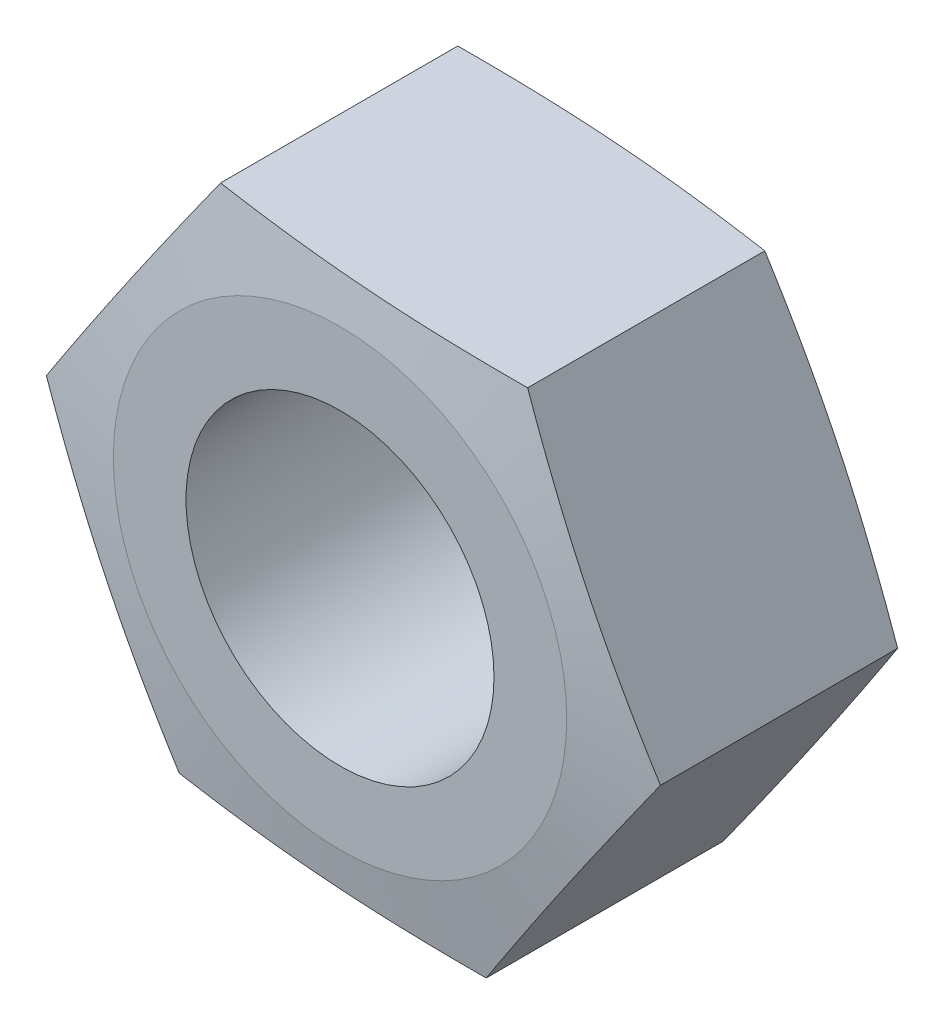
ISO-10303-21;
HEADER;
FILE_DESCRIPTION(('STEP AP214'),'2;1');
FILE_NAME('part.step','',(''),(''),'','','');
FILE_SCHEMA(('AUTOMOTIVE_DESIGN { 1 0 10303 214 1 1 1 1 }'));
ENDSEC;
DATA;
#1=APPLICATION_CONTEXT('core data for automotive mechanical design processes');
#2=APPLICATION_PROTOCOL_DEFINITION('international standard','automotive_design',2000,#1);
#3=PRODUCT_CONTEXT('',#1,'mechanical');
#4=PRODUCT('Part','Part','',(#3));
#5=PRODUCT_RELATED_PRODUCT_CATEGORY('part','',(#4));
#6=PRODUCT_DEFINITION_FORMATION('','',#4);
#7=PRODUCT_DEFINITION_CONTEXT('part definition',#1,'design');
#8=PRODUCT_DEFINITION('design','',#6,#7);
#9=PRODUCT_DEFINITION_SHAPE('','',#8);
#10=(LENGTH_UNIT() NAMED_UNIT(*) SI_UNIT(.MILLI.,.METRE.));
#11=(NAMED_UNIT(*) PLANE_ANGLE_UNIT() SI_UNIT($,.RADIAN.));
#12=(NAMED_UNIT(*) SI_UNIT($,.STERADIAN.) SOLID_ANGLE_UNIT());
#13=UNCERTAINTY_MEASURE_WITH_UNIT(LENGTH_MEASURE(1.E-05),#10,'distance_accuracy_value','');
#14=(GEOMETRIC_REPRESENTATION_CONTEXT(3) GLOBAL_UNCERTAINTY_ASSIGNED_CONTEXT((#13)) GLOBAL_UNIT_ASSIGNED_CONTEXT((#10,
#11,#12)) REPRESENTATION_CONTEXT('',''));
#15=CARTESIAN_POINT('',(0.,0.,0.));
#16=DIRECTION('',(0.,0.,1.));
#17=DIRECTION('',(1.,0.,0.));
#18=AXIS2_PLACEMENT_3D('',#15,#16,#17);
#19=CARTESIAN_POINT('',(3.95969488494093,5.77241859346432,6.00000000000001));
#20=DIRECTION('',(-0.0775695806945686,-0.996986940812601,0.));
#21=DIRECTION('',(0.996986940812601,-0.0775695806945686,0.));
#22=AXIS2_PLACEMENT_3D('',#19,#20,#21);
#23=PLANE('',#22);
#24=DIRECTION('',(0.,0.,-1.));
#25=VECTOR('',#24,1.);
#26=CARTESIAN_POINT('',(-3.01921370074727,6.31540565832631,6.00000000000001));
#27=LINE('',#26,#25);
#28=CARTESIAN_POINT('',(-3.01921370074727,6.31540565832631,5.69512801008326));
#29=VERTEX_POINT('',#28);
#30=CARTESIAN_POINT('',(-3.01921370074727,6.31540565832631,0.304871989916744));
#31=VERTEX_POINT('',#30);
#32=EDGE_CURVE('E95',#29,#31,#27,.T.);
#33=ORIENTED_EDGE('',*,*,#32,.F.);
#34=CARTESIAN_POINT('',(-3.01941370074728,6.31542121912806,5.69511146205982));
#35=CARTESIAN_POINT('',(-2.72897992964296,6.29282430745162,5.71915233345576));
#36=CARTESIAN_POINT('',(-2.43834440494557,6.27021169853686,5.74094451981429));
#37=CARTESIAN_POINT('',(-1.85668362504621,6.22495615811173,5.77919222813011));
#38=CARTESIAN_POINT('',(-1.56565831827238,6.20231322258887,5.79564695524422));
#39=CARTESIAN_POINT('',(-0.983890870501997,6.15704938297576,5.82234651229677));
#40=CARTESIAN_POINT('',(-0.693149298202373,6.13442852313243,5.83260349116446));
#41=CARTESIAN_POINT('',(-0.111524945626128,6.08917581689906,5.84635405536407));
#42=CARTESIAN_POINT('',(0.179357823235346,6.06654397139719,5.84984811801812));
#43=CARTESIAN_POINT('',(0.761123360958293,6.02128028039343,5.84984811801812));
#44=CARTESIAN_POINT('',(1.05200612981977,5.99864843489156,5.84635405536407));
#45=CARTESIAN_POINT('',(1.63363048239601,5.9533957286582,5.83260349116446));
#46=CARTESIAN_POINT('',(1.92437205469564,5.93077486881486,5.82234651229677));
#47=CARTESIAN_POINT('',(2.50613950246602,5.88551102920176,5.79564695524422));
#48=CARTESIAN_POINT('',(2.79716480923985,5.8628680936789,5.77919222813011));
#49=CARTESIAN_POINT('',(3.37882558913921,5.81761255325377,5.74094451981429));
#50=CARTESIAN_POINT('',(3.6694611138366,5.79499994433901,5.71915233345576));
#51=CARTESIAN_POINT('',(3.95989488494092,5.77240303266257,5.69511146205982));
#52=B_SPLINE_CURVE_WITH_KNOTS('',3,(#34,#35,#36,#37,#38,#39,#40,#41,#42,#43,#44,#45,#46,#47,#48,
#49,#50,#51),.UNSPECIFIED.,.F.,.F.,(4,2,2,2,2,2,2,2,4),(0.,0.876922006702676,1.75397454289322,
2.6293022412504,3.50456815730537,4.37983407336034,5.25516177171752,6.13221430790806,
7.00913631461074),.UNSPECIFIED.);
#53=CARTESIAN_POINT('',(3.95969488494093,5.77241859346432,5.69512801008326));
#54=VERTEX_POINT('',#53);
#55=EDGE_CURVE('E88',#29,#54,#52,.T.);
#56=ORIENTED_EDGE('',*,*,#55,.T.);
#57=DIRECTION('',(0.,0.,-1.));
#58=VECTOR('',#57,1.);
#59=CARTESIAN_POINT('',(3.95969488494093,5.77241859346432,6.00000000000001));
#60=LINE('',#59,#58);
#61=CARTESIAN_POINT('',(3.95969488494093,5.77241859346432,0.304871989916744));
#62=VERTEX_POINT('',#61);
#63=EDGE_CURVE('E57',#54,#62,#60,.T.);
#64=ORIENTED_EDGE('',*,*,#63,.T.);
#65=CARTESIAN_POINT('',(-3.01941370074728,6.31542121912806,0.304888537940182));
#66=CARTESIAN_POINT('',(-2.72897992964296,6.29282430745162,0.280847666544248));
#67=CARTESIAN_POINT('',(-2.43834440494557,6.27021169853686,0.259055480185718));
#68=CARTESIAN_POINT('',(-1.85668362504621,6.22495615811173,0.220807771869897));
#69=CARTESIAN_POINT('',(-1.56565831827238,6.20231322258887,0.204353044755786));
#70=CARTESIAN_POINT('',(-0.983890870501997,6.15704938297576,0.177653487703237));
#71=CARTESIAN_POINT('',(-0.693149298202373,6.13442852313243,0.167396508835543));
#72=CARTESIAN_POINT('',(-0.111524945626128,6.08917581689906,0.15364594463594));
#73=CARTESIAN_POINT('',(0.179357823235346,6.06654397139719,0.150151881981885));
#74=CARTESIAN_POINT('',(0.761123360958293,6.02128028039343,0.150151881981884));
#75=CARTESIAN_POINT('',(1.05200612981977,5.99864843489156,0.15364594463594));
#76=CARTESIAN_POINT('',(1.63363048239601,5.9533957286582,0.167396508835543));
#77=CARTESIAN_POINT('',(1.92437205469564,5.93077486881486,0.177653487703237));
#78=CARTESIAN_POINT('',(2.50613950246602,5.88551102920176,0.204353044755785));
#79=CARTESIAN_POINT('',(2.79716480923985,5.8628680936789,0.220807771869896));
#80=CARTESIAN_POINT('',(3.37882558913921,5.81761255325377,0.259055480185718));
#81=CARTESIAN_POINT('',(3.6694611138366,5.79499994433901,0.280847666544247));
#82=CARTESIAN_POINT('',(3.95989488494092,5.77240303266257,0.304888537940182));
#83=B_SPLINE_CURVE_WITH_KNOTS('',3,(#65,#66,#67,#68,#69,#70,#71,#72,#73,#74,#75,#76,#77,#78,#79,
#80,#81,#82),.UNSPECIFIED.,.F.,.F.,(4,2,2,2,2,2,2,2,4),(0.,0.876922006702676,1.75397454289322,
2.6293022412504,3.50456815730537,4.37983407336034,5.25516177171752,6.13221430790806,
7.00913631461074),.UNSPECIFIED.);
#84=EDGE_CURVE('E104',#31,#62,#83,.T.);
#85=ORIENTED_EDGE('',*,*,#84,.F.);
#86=EDGE_LOOP('',(#33,#56,#64,#85));
#87=FACE_BOUND('',#86,.T.);
#88=ADVANCED_FACE('F34',(#87),#23,.F.);
#89=CARTESIAN_POINT('',(-3.01921370074727,6.31540565832631,6.00000000000001));
#90=DIRECTION('',(0.824631227637761,-0.565670697848704,0.));
#91=DIRECTION('',(0.565670697848704,0.824631227637761,0.));
#92=AXIS2_PLACEMENT_3D('',#89,#90,#91);
#93=PLANE('',#92);
#94=DIRECTION('',(0.,0.,-1.));
#95=VECTOR('',#94,1.);
#96=CARTESIAN_POINT('',(-6.9789085856882,0.542987064861979,6.00000000000001));
#97=LINE('',#96,#95);
#98=CARTESIAN_POINT('',(-6.9789085856882,0.542987064861979,5.69512801008326));
#99=VERTEX_POINT('',#98);
#100=CARTESIAN_POINT('',(-6.9789085856882,0.542987064861979,0.304871989916744));
#101=VERTEX_POINT('',#100);
#102=EDGE_CURVE('E119',#99,#101,#97,.T.);
#103=ORIENTED_EDGE('',*,*,#102,.F.);
#104=CARTESIAN_POINT('',(-6.97904577930369,0.54278706486198,5.6951080032768));
#105=CARTESIAN_POINT('',(-6.81425742348327,0.783014505804924,5.71914937749612));
#106=CARTESIAN_POINT('',(-6.64935459379656,1.02340882603868,5.74094203471259));
#107=CARTESIAN_POINT('',(-6.31932780217191,1.50451983172767,5.77919058750341));
#108=CARTESIAN_POINT('',(-6.15420381097108,1.74523655984218,5.79564568818704));
#109=CARTESIAN_POINT('',(-5.8241164965703,2.22643579525807,5.82234586018379));
#110=CARTESIAN_POINT('',(-5.65915349605505,2.46691783215169,5.83260308093769));
#111=CARTESIAN_POINT('',(-5.32914737378096,2.94799870618991,5.84635397117812));
#112=CARTESIAN_POINT('',(-5.16410425849935,3.18859753389203,5.84984811801812));
#113=CARTESIAN_POINT('',(-4.83401802793612,3.66979518929626,5.84984811801812));
#114=CARTESIAN_POINT('',(-4.66897491265451,3.91039401699838,5.84635397117812));
#115=CARTESIAN_POINT('',(-4.33896879038042,4.39147489103659,5.83260308093769));
#116=CARTESIAN_POINT('',(-4.17400578986517,4.63195692793022,5.82234586018379));
#117=CARTESIAN_POINT('',(-3.84391847546439,5.11315616334611,5.79564568818704));
#118=CARTESIAN_POINT('',(-3.67879448426356,5.35387289146061,5.77919058750341));
#119=CARTESIAN_POINT('',(-3.34876769263891,5.83498389714961,5.74094203471259));
#120=CARTESIAN_POINT('',(-3.1838648629522,6.07537821738336,5.71914937749612));
#121=CARTESIAN_POINT('',(-3.01907650713178,6.31560565832631,5.6951080032768));
#122=B_SPLINE_CURVE_WITH_KNOTS('',3,(#104,#105,#106,#107,#108,#109,#110,#111,#112,#113,#114,
#115,#116,#117,#118,#119,#120,#121),.UNSPECIFIED.,.F.,.F.,(4,2,2,2,2,2,2,2,4),(0.,
0.876932547901869,1.75399563228697,2.62933382198641,3.50461022602738,4.37988663006836,
5.2552248197678,6.1322879041529,7.00922045205477),.UNSPECIFIED.);
#123=EDGE_CURVE('E97',#99,#29,#122,.T.);
#124=ORIENTED_EDGE('',*,*,#123,.T.);
#125=ORIENTED_EDGE('',*,*,#32,.T.);
#126=CARTESIAN_POINT('',(-6.97904577930369,0.54278706486198,0.304891996723206));
#127=CARTESIAN_POINT('',(-6.81425742348327,0.783014505804923,0.280850622503883));
#128=CARTESIAN_POINT('',(-6.64935459379656,1.02340882603868,0.259057965287416));
#129=CARTESIAN_POINT('',(-6.31932780217191,1.50451983172767,0.220809412496592));
#130=CARTESIAN_POINT('',(-6.15420381097108,1.74523655984218,0.204354311812964));
#131=CARTESIAN_POINT('',(-5.8241164965703,2.22643579525807,0.177654139816218));
#132=CARTESIAN_POINT('',(-5.65915349605505,2.46691783215169,0.167396919062313));
#133=CARTESIAN_POINT('',(-5.32914737378096,2.94799870618991,0.153646028821889));
#134=CARTESIAN_POINT('',(-5.16410425849935,3.18859753389203,0.150151881981884));
#135=CARTESIAN_POINT('',(-4.83401802793612,3.66979518929626,0.150151881981884));
#136=CARTESIAN_POINT('',(-4.66897491265451,3.91039401699838,0.153646028821889));
#137=CARTESIAN_POINT('',(-4.33896879038042,4.39147489103659,0.167396919062314));
#138=CARTESIAN_POINT('',(-4.17400578986517,4.63195692793022,0.177654139816218));
#139=CARTESIAN_POINT('',(-3.84391847546439,5.11315616334611,0.204354311812964));
#140=CARTESIAN_POINT('',(-3.67879448426356,5.35387289146061,0.220809412496593));
#141=CARTESIAN_POINT('',(-3.34876769263891,5.83498389714961,0.259057965287417));
#142=CARTESIAN_POINT('',(-3.1838648629522,6.07537821738336,0.280850622503884));
#143=CARTESIAN_POINT('',(-3.01907650713178,6.31560565832631,0.304891996723206));
#144=B_SPLINE_CURVE_WITH_KNOTS('',3,(#126,#127,#128,#129,#130,#131,#132,#133,#134,#135,#136,
#137,#138,#139,#140,#141,#142,#143),.UNSPECIFIED.,.F.,.F.,(4,2,2,2,2,2,2,2,4),(0.,
0.876932547901869,1.75399563228697,2.62933382198641,3.50461022602738,4.37988663006836,
5.2552248197678,6.1322879041529,7.00922045205477),.UNSPECIFIED.);
#145=EDGE_CURVE('E108',#101,#31,#144,.T.);
#146=ORIENTED_EDGE('',*,*,#145,.F.);
#147=EDGE_LOOP('',(#103,#124,#125,#146));
#148=FACE_BOUND('',#147,.T.);
#149=ADVANCED_FACE('F138',(#148),#93,.F.);
#150=CARTESIAN_POINT('',(-6.9789085856882,0.542987064861979,6.00000000000001));
#151=DIRECTION('',(0.902200808332329,0.431316242963897,0.));
#152=DIRECTION('',(-0.431316242963897,0.902200808332329,0.));
#153=AXIS2_PLACEMENT_3D('',#150,#151,#152);
#154=PLANE('',#153);
#155=DIRECTION('',(0.,0.,-1.));
#156=VECTOR('',#155,1.);
#157=CARTESIAN_POINT('',(-3.95969488494093,-5.77241859346432,6.00000000000001));
#158=LINE('',#157,#156);
#159=CARTESIAN_POINT('',(-3.95969488494093,-5.77241859346432,5.69512801008326));
#160=VERTEX_POINT('',#159);
#161=CARTESIAN_POINT('',(-3.95969488494093,-5.77241859346432,0.304871989916744));
#162=VERTEX_POINT('',#161);
#163=EDGE_CURVE('E117',#160,#162,#158,.T.);
#164=ORIENTED_EDGE('',*,*,#163,.F.);
#165=CARTESIAN_POINT('',(-3.95959927069651,-5.77261859346433,5.69510972346639));
#166=CARTESIAN_POINT('',(-4.0852474120088,-5.509795533803,5.71915084761193));
#167=CARTESIAN_POINT('',(-4.21098283700761,-5.24678989949066,5.74094327065221));
#168=CARTESIAN_POINT('',(-4.46262229474898,-4.72042594755022,5.77919140345228));
#169=CARTESIAN_POINT('',(-4.58852634980334,-4.4570675832517,5.79564631834498));
#170=CARTESIAN_POINT('',(-4.84021195476017,-3.93060710340218,5.82234618450557));
#171=CARTESIAN_POINT('',(-4.9659932586265,-3.66750550249448,5.83260328495983));
#172=CARTESIAN_POINT('',(-5.21761695672581,-3.14117451560473,5.84635401304715));
#173=CARTESIAN_POINT('',(-5.34345934602018,-2.87794513995295,5.84984811801812));
#174=CARTESIAN_POINT('',(-5.59514412460893,-2.35148638864939,5.84984811801812));
#175=CARTESIAN_POINT('',(-5.72098651390331,-2.08825701299762,5.84635401304715));
#176=CARTESIAN_POINT('',(-5.97261021200262,-1.56192602610786,5.83260328495983));
#177=CARTESIAN_POINT('',(-6.09839151586895,-1.29882442520017,5.82234618450557));
#178=CARTESIAN_POINT('',(-6.35007712082578,-0.772363945350646,5.79564631834498));
#179=CARTESIAN_POINT('',(-6.47598117588013,-0.509005581052128,5.77919140345228));
#180=CARTESIAN_POINT('',(-6.72762063362151,0.0173583708883153,5.74094327065221));
#181=CARTESIAN_POINT('',(-6.85335605862032,0.280364005200656,5.71915084761193));
#182=CARTESIAN_POINT('',(-6.97900419993261,0.543187064861977,5.69510972346639));
#183=B_SPLINE_CURVE_WITH_KNOTS('',3,(#165,#166,#167,#168,#169,#170,#171,#172,#173,#174,#175,
#176,#177,#178,#179,#180,#181,#182),.UNSPECIFIED.,.F.,.F.,(4,2,2,2,2,2,2,2,4),(0.,
0.8769273053583,1.75398514372074,2.62931811567248,3.50458930363497,4.37986049159746,
5.2551934635492,6.13225130191164,7.00917860726994),.UNSPECIFIED.);
#184=EDGE_CURVE('E187',#160,#99,#183,.T.);
#185=ORIENTED_EDGE('',*,*,#184,.T.);
#186=ORIENTED_EDGE('',*,*,#102,.T.);
#187=CARTESIAN_POINT('',(-3.95959927069651,-5.77261859346433,0.304890276533604));
#188=CARTESIAN_POINT('',(-4.0852474120088,-5.509795533803,0.280849152388072));
#189=CARTESIAN_POINT('',(-4.21098283700761,-5.24678989949066,0.259056729347796));
#190=CARTESIAN_POINT('',(-4.46262229474898,-4.72042594755022,0.22080859654773));
#191=CARTESIAN_POINT('',(-4.58852634980334,-4.4570675832517,0.204353681655022));
#192=CARTESIAN_POINT('',(-4.84021195476017,-3.93060710340218,0.177653815494437));
#193=CARTESIAN_POINT('',(-4.9659932586265,-3.66750550249448,0.167396715040179));
#194=CARTESIAN_POINT('',(-5.21761695672581,-3.14117451560473,0.153645986952852));
#195=CARTESIAN_POINT('',(-5.34345934602018,-2.87794513995295,0.150151881981884));
#196=CARTESIAN_POINT('',(-5.59514412460893,-2.35148638864939,0.150151881981884));
#197=CARTESIAN_POINT('',(-5.72098651390331,-2.08825701299762,0.153645986952852));
#198=CARTESIAN_POINT('',(-5.97261021200262,-1.56192602610786,0.167396715040179));
#199=CARTESIAN_POINT('',(-6.09839151586895,-1.29882442520017,0.177653815494436));
#200=CARTESIAN_POINT('',(-6.35007712082578,-0.772363945350647,0.204353681655021));
#201=CARTESIAN_POINT('',(-6.47598117588013,-0.509005581052128,0.22080859654773));
#202=CARTESIAN_POINT('',(-6.72762063362151,0.0173583708883149,0.259056729347796));
#203=CARTESIAN_POINT('',(-6.85335605862032,0.280364005200656,0.280849152388072));
#204=CARTESIAN_POINT('',(-6.97900419993261,0.543187064861977,0.304890276533604));
#205=B_SPLINE_CURVE_WITH_KNOTS('',3,(#187,#188,#189,#190,#191,#192,#193,#194,#195,#196,#197,
#198,#199,#200,#201,#202,#203,#204),.UNSPECIFIED.,.F.,.F.,(4,2,2,2,2,2,2,2,4),(0.,
0.8769273053583,1.75398514372074,2.62931811567248,3.50458930363497,4.37986049159746,
5.2551934635492,6.13225130191164,7.00917860726994),.UNSPECIFIED.);
#206=EDGE_CURVE('E199',#162,#101,#205,.T.);
#207=ORIENTED_EDGE('',*,*,#206,.F.);
#208=EDGE_LOOP('',(#164,#185,#186,#207));
#209=FACE_BOUND('',#208,.T.);
#210=ADVANCED_FACE('F142',(#209),#154,.F.);
#211=CARTESIAN_POINT('',(-3.95969488494093,-5.77241859346432,6.00000000000001));
#212=DIRECTION('',(0.0775695806945687,0.996986940812601,0.));
#213=DIRECTION('',(-0.996986940812601,0.0775695806945687,0.));
#214=AXIS2_PLACEMENT_3D('',#211,#212,#213);
#215=PLANE('',#214);
#216=DIRECTION('',(0.,0.,-1.));
#217=VECTOR('',#216,1.);
#218=CARTESIAN_POINT('',(3.01921370074727,-6.31540565832631,6.00000000000001));
#219=LINE('',#218,#217);
#220=CARTESIAN_POINT('',(3.01921370074727,-6.31540565832631,5.69512801008326));
#221=VERTEX_POINT('',#220);
#222=CARTESIAN_POINT('',(3.01921370074727,-6.31540565832631,0.304871989916744));
#223=VERTEX_POINT('',#222);
#224=EDGE_CURVE('E106',#221,#223,#219,.T.);
#225=ORIENTED_EDGE('',*,*,#224,.F.);
#226=CARTESIAN_POINT('',(3.01941370074728,-6.31542121912806,5.69511146205982));
#227=CARTESIAN_POINT('',(2.72897992964296,-6.29282430745162,5.71915233345576));
#228=CARTESIAN_POINT('',(2.43834440494557,-6.27021169853685,5.74094451981429));
#229=CARTESIAN_POINT('',(1.85668362504621,-6.22495615811173,5.77919222813011));
#230=CARTESIAN_POINT('',(1.56565831827238,-6.20231322258887,5.79564695524422));
#231=CARTESIAN_POINT('',(0.983890870501997,-6.15704938297577,5.82234651229677));
#232=CARTESIAN_POINT('',(0.693149298202373,-6.13442852313243,5.83260349116446));
#233=CARTESIAN_POINT('',(0.111524945626128,-6.08917581689906,5.84635405536407));
#234=CARTESIAN_POINT('',(-0.179357823235346,-6.06654397139719,5.84984811801812));
#235=CARTESIAN_POINT('',(-0.761123360958294,-6.02128028039343,5.84984811801812));
#236=CARTESIAN_POINT('',(-1.05200612981977,-5.99864843489156,5.84635405536407));
#237=CARTESIAN_POINT('',(-1.63363048239601,-5.9533957286582,5.83260349116446));
#238=CARTESIAN_POINT('',(-1.92437205469564,-5.93077486881486,5.82234651229677));
#239=CARTESIAN_POINT('',(-2.50613950246602,-5.88551102920176,5.79564695524422));
#240=CARTESIAN_POINT('',(-2.79716480923985,-5.8628680936789,5.77919222813011));
#241=CARTESIAN_POINT('',(-3.37882558913921,-5.81761255325377,5.74094451981429));
#242=CARTESIAN_POINT('',(-3.6694611138366,-5.794999944339,5.71915233345576));
#243=CARTESIAN_POINT('',(-3.95989488494092,-5.77240303266256,5.69511146205982));
#244=B_SPLINE_CURVE_WITH_KNOTS('',3,(#226,#227,#228,#229,#230,#231,#232,#233,#234,#235,#236,
#237,#238,#239,#240,#241,#242,#243),.UNSPECIFIED.,.F.,.F.,(4,2,2,2,2,2,2,2,4),(0.,
0.876922006702676,1.75397454289322,2.6293022412504,3.50456815730537,4.37983407336034,
5.25516177171752,6.13221430790807,7.00913631461074),.UNSPECIFIED.);
#245=EDGE_CURVE('E182',#221,#160,#244,.T.);
#246=ORIENTED_EDGE('',*,*,#245,.T.);
#247=ORIENTED_EDGE('',*,*,#163,.T.);
#248=CARTESIAN_POINT('',(3.01941370074728,-6.31542121912806,0.304888537940182));
#249=CARTESIAN_POINT('',(2.72897992964296,-6.29282430745162,0.280847666544248));
#250=CARTESIAN_POINT('',(2.43834440494557,-6.27021169853685,0.259055480185718));
#251=CARTESIAN_POINT('',(1.85668362504621,-6.22495615811173,0.220807771869897));
#252=CARTESIAN_POINT('',(1.56565831827238,-6.20231322258887,0.204353044755786));
#253=CARTESIAN_POINT('',(0.983890870501997,-6.15704938297577,0.177653487703237));
#254=CARTESIAN_POINT('',(0.693149298202373,-6.13442852313243,0.167396508835543));
#255=CARTESIAN_POINT('',(0.111524945626128,-6.08917581689907,0.15364594463594));
#256=CARTESIAN_POINT('',(-0.179357823235346,-6.06654397139719,0.150151881981885));
#257=CARTESIAN_POINT('',(-0.761123360958294,-6.02128028039343,0.150151881981885));
#258=CARTESIAN_POINT('',(-1.05200612981977,-5.99864843489156,0.15364594463594));
#259=CARTESIAN_POINT('',(-1.63363048239601,-5.9533957286582,0.167396508835543));
#260=CARTESIAN_POINT('',(-1.92437205469564,-5.93077486881486,0.177653487703237));
#261=CARTESIAN_POINT('',(-2.50613950246602,-5.88551102920176,0.204353044755785));
#262=CARTESIAN_POINT('',(-2.79716480923985,-5.8628680936789,0.220807771869896));
#263=CARTESIAN_POINT('',(-3.37882558913921,-5.81761255325377,0.259055480185718));
#264=CARTESIAN_POINT('',(-3.6694611138366,-5.794999944339,0.280847666544248));
#265=CARTESIAN_POINT('',(-3.95989488494092,-5.77240303266256,0.304888537940182));
#266=B_SPLINE_CURVE_WITH_KNOTS('',3,(#248,#249,#250,#251,#252,#253,#254,#255,#256,#257,#258,
#259,#260,#261,#262,#263,#264,#265),.UNSPECIFIED.,.F.,.F.,(4,2,2,2,2,2,2,2,4),(0.,
0.876922006702676,1.75397454289322,2.6293022412504,3.50456815730537,4.37983407336034,
5.25516177171752,6.13221430790807,7.00913631461074),.UNSPECIFIED.);
#267=EDGE_CURVE('E205',#223,#162,#266,.T.);
#268=ORIENTED_EDGE('',*,*,#267,.F.);
#269=EDGE_LOOP('',(#225,#246,#247,#268));
#270=FACE_BOUND('',#269,.T.);
#271=ADVANCED_FACE('F194',(#270),#215,.F.);
#272=CARTESIAN_POINT('',(3.01921370074727,-6.31540565832631,6.00000000000001));
#273=DIRECTION('',(-0.824631227637761,0.565670697848704,0.));
#274=DIRECTION('',(-0.565670697848704,-0.824631227637761,0.));
#275=AXIS2_PLACEMENT_3D('',#272,#273,#274);
#276=PLANE('',#275);
#277=DIRECTION('',(0.,0.,-1.));
#278=VECTOR('',#277,1.);
#279=CARTESIAN_POINT('',(6.9789085856882,-0.542987064861979,6.00000000000001));
#280=LINE('',#279,#278);
#281=CARTESIAN_POINT('',(6.9789085856882,-0.542987064861979,5.69512801008326));
#282=VERTEX_POINT('',#281);
#283=CARTESIAN_POINT('',(6.9789085856882,-0.542987064861979,0.304871989916744));
#284=VERTEX_POINT('',#283);
#285=EDGE_CURVE('E103',#282,#284,#280,.T.);
#286=ORIENTED_EDGE('',*,*,#285,.F.);
#287=CARTESIAN_POINT('',(6.97904577930369,-0.54278706486198,5.6951080032768));
#288=CARTESIAN_POINT('',(6.81425742348327,-0.783014505804923,5.71914937749612));
#289=CARTESIAN_POINT('',(6.64935459379656,-1.02340882603867,5.74094203471259));
#290=CARTESIAN_POINT('',(6.31932780217191,-1.50451983172767,5.77919058750341));
#291=CARTESIAN_POINT('',(6.15420381097108,-1.74523655984218,5.79564568818704));
#292=CARTESIAN_POINT('',(5.8241164965703,-2.22643579525806,5.82234586018379));
#293=CARTESIAN_POINT('',(5.65915349605506,-2.46691783215169,5.83260308093769));
#294=CARTESIAN_POINT('',(5.32914737378097,-2.9479987061899,5.84635397117812));
#295=CARTESIAN_POINT('',(5.16410425849935,-3.18859753389202,5.84984811801812));
#296=CARTESIAN_POINT('',(4.83401802793613,-3.66979518929625,5.84984811801812));
#297=CARTESIAN_POINT('',(4.66897491265452,-3.91039401699837,5.84635397117812));
#298=CARTESIAN_POINT('',(4.33896879038042,-4.39147489103658,5.83260308093769));
#299=CARTESIAN_POINT('',(4.17400578986518,-4.63195692793021,5.82234586018379));
#300=CARTESIAN_POINT('',(3.8439184754644,-5.1131561633461,5.79564568818704));
#301=CARTESIAN_POINT('',(3.67879448426357,-5.3538728914606,5.77919058750341));
#302=CARTESIAN_POINT('',(3.34876769263892,-5.8349838971496,5.74094203471259));
#303=CARTESIAN_POINT('',(3.18386486295221,-6.07537821738335,5.71914937749612));
#304=CARTESIAN_POINT('',(3.01907650713179,-6.3156056583263,5.6951080032768));
#305=B_SPLINE_CURVE_WITH_KNOTS('',3,(#287,#288,#289,#290,#291,#292,#293,#294,#295,#296,#297,
#298,#299,#300,#301,#302,#303,#304),.UNSPECIFIED.,.F.,.F.,(4,2,2,2,2,2,2,2,4),(0.,
0.876932547901866,1.75399563228697,2.62933382198641,3.50461022602738,4.37988663006835,
5.25522481976779,6.13228790415289,7.00922045205476),.UNSPECIFIED.);
#306=EDGE_CURVE('E49',#282,#221,#305,.T.);
#307=ORIENTED_EDGE('',*,*,#306,.T.);
#308=ORIENTED_EDGE('',*,*,#224,.T.);
#309=CARTESIAN_POINT('',(6.97904577930369,-0.54278706486198,0.304891996723206));
#310=CARTESIAN_POINT('',(6.81425742348327,-0.783014505804923,0.280850622503883));
#311=CARTESIAN_POINT('',(6.64935459379656,-1.02340882603868,0.259057965287416));
#312=CARTESIAN_POINT('',(6.31932780217191,-1.50451983172767,0.220809412496592));
#313=CARTESIAN_POINT('',(6.15420381097108,-1.74523655984218,0.204354311812964));
#314=CARTESIAN_POINT('',(5.8241164965703,-2.22643579525806,0.177654139816218));
#315=CARTESIAN_POINT('',(5.65915349605506,-2.46691783215169,0.167396919062314));
#316=CARTESIAN_POINT('',(5.32914737378096,-2.9479987061899,0.153646028821889));
#317=CARTESIAN_POINT('',(5.16410425849935,-3.18859753389202,0.150151881981884));
#318=CARTESIAN_POINT('',(4.83401802793613,-3.66979518929625,0.150151881981884));
#319=CARTESIAN_POINT('',(4.66897491265452,-3.91039401699837,0.153646028821889));
#320=CARTESIAN_POINT('',(4.33896879038042,-4.39147489103658,0.167396919062313));
#321=CARTESIAN_POINT('',(4.17400578986518,-4.63195692793021,0.177654139816218));
#322=CARTESIAN_POINT('',(3.8439184754644,-5.1131561633461,0.204354311812964));
#323=CARTESIAN_POINT('',(3.67879448426357,-5.3538728914606,0.220809412496592));
#324=CARTESIAN_POINT('',(3.34876769263892,-5.8349838971496,0.259057965287416));
#325=CARTESIAN_POINT('',(3.18386486295221,-6.07537821738335,0.280850622503883));
#326=CARTESIAN_POINT('',(3.01907650713179,-6.3156056583263,0.304891996723206));
#327=B_SPLINE_CURVE_WITH_KNOTS('',3,(#309,#310,#311,#312,#313,#314,#315,#316,#317,#318,#319,
#320,#321,#322,#323,#324,#325,#326),.UNSPECIFIED.,.F.,.F.,(4,2,2,2,2,2,2,2,4),(0.,
0.876932547901867,1.75399563228697,2.62933382198641,3.50461022602738,4.37988663006835,
5.25522481976779,6.13228790415289,7.00922045205475),.UNSPECIFIED.);
#328=EDGE_CURVE('E226',#284,#223,#327,.T.);
#329=ORIENTED_EDGE('',*,*,#328,.F.);
#330=EDGE_LOOP('',(#286,#307,#308,#329));
#331=FACE_BOUND('',#330,.T.);
#332=ADVANCED_FACE('F233',(#331),#276,.F.);
#333=CARTESIAN_POINT('',(6.9789085856882,-0.542987064861979,6.00000000000001));
#334=DIRECTION('',(-0.902200808332329,-0.431316242963898,0.));
#335=DIRECTION('',(0.431316242963898,-0.902200808332329,0.));
#336=AXIS2_PLACEMENT_3D('',#333,#334,#335);
#337=PLANE('',#336);
#338=ORIENTED_EDGE('',*,*,#63,.F.);
#339=CARTESIAN_POINT('',(3.95959927069651,5.77261859346433,5.69510972346639));
#340=CARTESIAN_POINT('',(4.08524741200879,5.509795533803,5.71915084761193));
#341=CARTESIAN_POINT('',(4.2109828370076,5.24678989949066,5.74094327065221));
#342=CARTESIAN_POINT('',(4.46262229474898,4.72042594755022,5.77919140345228));
#343=CARTESIAN_POINT('',(4.58852634980333,4.4570675832517,5.79564631834498));
#344=CARTESIAN_POINT('',(4.84021195476017,3.93060710340218,5.82234618450557));
#345=CARTESIAN_POINT('',(4.96599325862649,3.66750550249448,5.83260328495983));
#346=CARTESIAN_POINT('',(5.21761695672581,3.14117451560473,5.84635401304715));
#347=CARTESIAN_POINT('',(5.34345934602018,2.87794513995295,5.84984811801812));
#348=CARTESIAN_POINT('',(5.59514412460893,2.35148638864939,5.84984811801812));
#349=CARTESIAN_POINT('',(5.72098651390331,2.08825701299762,5.84635401304715));
#350=CARTESIAN_POINT('',(5.97261021200262,1.56192602610786,5.83260328495983));
#351=CARTESIAN_POINT('',(6.09839151586895,1.29882442520017,5.82234618450557));
#352=CARTESIAN_POINT('',(6.35007712082578,0.772363945350646,5.79564631834498));
#353=CARTESIAN_POINT('',(6.47598117588013,0.509005581052128,5.77919140345228));
#354=CARTESIAN_POINT('',(6.72762063362151,-0.0173583708883159,5.74094327065221));
#355=CARTESIAN_POINT('',(6.85335605862032,-0.280364005200657,5.71915084761193));
#356=CARTESIAN_POINT('',(6.97900419993261,-0.543187064861977,5.69510972346639));
#357=B_SPLINE_CURVE_WITH_KNOTS('',3,(#339,#340,#341,#342,#343,#344,#345,#346,#347,#348,#349,
#350,#351,#352,#353,#354,#355,#356),.UNSPECIFIED.,.F.,.F.,(4,2,2,2,2,2,2,2,4),(0.,
0.876927305358301,1.75398514372074,2.62931811567248,3.50458930363497,4.37986049159746,
5.2551934635492,6.13225130191164,7.00917860726994),.UNSPECIFIED.);
#358=EDGE_CURVE('E86',#54,#282,#357,.T.);
#359=ORIENTED_EDGE('',*,*,#358,.T.);
#360=ORIENTED_EDGE('',*,*,#285,.T.);
#361=CARTESIAN_POINT('',(3.95959927069651,5.77261859346433,0.304890276533604));
#362=CARTESIAN_POINT('',(4.08524741200879,5.509795533803,0.280849152388072));
#363=CARTESIAN_POINT('',(4.2109828370076,5.24678989949066,0.259056729347796));
#364=CARTESIAN_POINT('',(4.46262229474898,4.72042594755022,0.22080859654773));
#365=CARTESIAN_POINT('',(4.58852634980333,4.4570675832517,0.204353681655021));
#366=CARTESIAN_POINT('',(4.84021195476017,3.93060710340218,0.177653815494436));
#367=CARTESIAN_POINT('',(4.96599325862649,3.66750550249448,0.167396715040179));
#368=CARTESIAN_POINT('',(5.21761695672581,3.14117451560473,0.153645986952852));
#369=CARTESIAN_POINT('',(5.34345934602018,2.87794513995295,0.150151881981884));
#370=CARTESIAN_POINT('',(5.59514412460893,2.35148638864939,0.150151881981884));
#371=CARTESIAN_POINT('',(5.72098651390331,2.08825701299762,0.153645986952852));
#372=CARTESIAN_POINT('',(5.97261021200262,1.56192602610786,0.167396715040179));
#373=CARTESIAN_POINT('',(6.09839151586895,1.29882442520017,0.177653815494436));
#374=CARTESIAN_POINT('',(6.35007712082578,0.772363945350646,0.204353681655021));
#375=CARTESIAN_POINT('',(6.47598117588013,0.509005581052127,0.22080859654773));
#376=CARTESIAN_POINT('',(6.72762063362151,-0.0173583708883159,0.259056729347796));
#377=CARTESIAN_POINT('',(6.85335605862032,-0.280364005200657,0.280849152388072));
#378=CARTESIAN_POINT('',(6.97900419993261,-0.543187064861977,0.304890276533604));
#379=B_SPLINE_CURVE_WITH_KNOTS('',3,(#361,#362,#363,#364,#365,#366,#367,#368,#369,#370,#371,
#372,#373,#374,#375,#376,#377,#378),.UNSPECIFIED.,.F.,.F.,(4,2,2,2,2,2,2,2,4),(0.,
0.876927305358301,1.75398514372074,2.62931811567248,3.50458930363497,4.37986049159746,
5.2551934635492,6.13225130191164,7.00917860726994),.UNSPECIFIED.);
#380=EDGE_CURVE('E102',#62,#284,#379,.T.);
#381=ORIENTED_EDGE('',*,*,#380,.F.);
#382=EDGE_LOOP('',(#338,#359,#360,#381));
#383=FACE_BOUND('',#382,.T.);
#384=ADVANCED_FACE('F100',(#383),#337,.F.);
#385=CARTESIAN_POINT('',(0.,0.,0.472678529458648));
#386=DIRECTION('',(0.,0.,1.));
#387=DIRECTION('',(1.,0.,0.));
#388=AXIS2_PLACEMENT_3D('',#385,#386,#387);
#389=CONICAL_SURFACE('',#388,8.01714441479362,1.40729104048334);
#390=CARTESIAN_POINT('',(0.,0.,0.));
#391=DIRECTION('',(0.,0.,1.));
#392=DIRECTION('',(1.,0.,0.));
#393=AXIS2_PLACEMENT_3D('',#390,#391,#392);
#394=CIRCLE('',#393,5.15204554830007);
#395=CARTESIAN_POINT('',(5.15204554830007,0.,0.));
#396=VERTEX_POINT('',#395);
#397=EDGE_CURVE('E96',#396,#396,#394,.T.);
#398=ORIENTED_EDGE('',*,*,#397,.T.);
#399=EDGE_LOOP('',(#398));
#400=FACE_BOUND('',#399,.T.);
#401=ORIENTED_EDGE('',*,*,#84,.T.);
#402=ORIENTED_EDGE('',*,*,#380,.T.);
#403=ORIENTED_EDGE('',*,*,#328,.T.);
#404=ORIENTED_EDGE('',*,*,#267,.T.);
#405=ORIENTED_EDGE('',*,*,#206,.T.);
#406=ORIENTED_EDGE('',*,*,#145,.T.);
#407=EDGE_LOOP('',(#401,#402,#403,#404,#405,#406));
#408=FACE_BOUND('',#407,.T.);
#409=ADVANCED_FACE('F163',(#400,#408),#389,.T.);
#410=CARTESIAN_POINT('',(-3.01921370074727,6.31540565832631,0.));
#411=DIRECTION('',(0.,0.,1.));
#412=DIRECTION('',(1.,0.,0.));
#413=AXIS2_PLACEMENT_3D('',#410,#411,#412);
#414=PLANE('',#413);
#415=CARTESIAN_POINT('',(0.,0.,0.));
#416=DIRECTION('',(0.,0.,1.));
#417=DIRECTION('',(1.,0.,0.));
#418=AXIS2_PLACEMENT_3D('',#415,#416,#417);
#419=CIRCLE('',#418,4.);
#420=CARTESIAN_POINT('',(4.,0.,0.));
#421=VERTEX_POINT('',#420);
#422=EDGE_CURVE('E42',#421,#421,#419,.T.);
#423=ORIENTED_EDGE('',*,*,#422,.T.);
#424=EDGE_LOOP('',(#423));
#425=FACE_BOUND('',#424,.T.);
#426=ORIENTED_EDGE('',*,*,#397,.F.);
#427=EDGE_LOOP('',(#426));
#428=FACE_BOUND('',#427,.T.);
#429=ADVANCED_FACE('F124',(#425,#428),#414,.F.);
#430=CARTESIAN_POINT('',(0.,0.,5.52732147054136));
#431=DIRECTION('',(0.,0.,-1.));
#432=DIRECTION('',(-1.,0.,0.));
#433=AXIS2_PLACEMENT_3D('',#430,#431,#432);
#434=CONICAL_SURFACE('',#433,8.01714441479362,1.40729104048334);
#435=CARTESIAN_POINT('',(0.,0.,6.00000000000001));
#436=DIRECTION('',(0.,0.,1.));
#437=DIRECTION('',(1.,0.,0.));
#438=AXIS2_PLACEMENT_3D('',#435,#436,#437);
#439=CIRCLE('',#438,5.15204554830007);
#440=CARTESIAN_POINT('',(5.15204554830007,0.,6.00000000000001));
#441=VERTEX_POINT('',#440);
#442=EDGE_CURVE('E92',#441,#441,#439,.T.);
#443=ORIENTED_EDGE('',*,*,#442,.F.);
#444=EDGE_LOOP('',(#443));
#445=FACE_BOUND('',#444,.T.);
#446=ORIENTED_EDGE('',*,*,#123,.F.);
#447=ORIENTED_EDGE('',*,*,#184,.F.);
#448=ORIENTED_EDGE('',*,*,#245,.F.);
#449=ORIENTED_EDGE('',*,*,#306,.F.);
#450=ORIENTED_EDGE('',*,*,#358,.F.);
#451=ORIENTED_EDGE('',*,*,#55,.F.);
#452=EDGE_LOOP('',(#446,#447,#448,#449,#450,#451));
#453=FACE_BOUND('',#452,.T.);
#454=ADVANCED_FACE('F87',(#445,#453),#434,.T.);
#455=CARTESIAN_POINT('',(-3.01921370074727,6.31540565832631,6.00000000000001));
#456=DIRECTION('',(0.,0.,1.));
#457=DIRECTION('',(1.,0.,0.));
#458=AXIS2_PLACEMENT_3D('',#455,#456,#457);
#459=PLANE('',#458);
#460=CARTESIAN_POINT('',(0.,0.,6.00000000000001));
#461=DIRECTION('',(0.,0.,1.));
#462=DIRECTION('',(1.,0.,0.));
#463=AXIS2_PLACEMENT_3D('',#460,#461,#462);
#464=CIRCLE('',#463,3.5);
#465=CARTESIAN_POINT('',(3.5,0.,6.00000000000001));
#466=VERTEX_POINT('',#465);
#467=EDGE_CURVE('E250',#466,#466,#464,.T.);
#468=ORIENTED_EDGE('',*,*,#467,.F.);
#469=EDGE_LOOP('',(#468));
#470=FACE_BOUND('',#469,.T.);
#471=ORIENTED_EDGE('',*,*,#442,.T.);
#472=EDGE_LOOP('',(#471));
#473=FACE_BOUND('',#472,.T.);
#474=ADVANCED_FACE('F133',(#470,#473),#459,.T.);
#475=CARTESIAN_POINT('',(0.,0.,0.));
#476=DIRECTION('',(0.,0.,1.));
#477=DIRECTION('',(1.,0.,0.));
#478=AXIS2_PLACEMENT_3D('',#475,#476,#477);
#479=CYLINDRICAL_SURFACE('',#478,3.5);
#480=CARTESIAN_POINT('',(0.,0.,0.5));
#481=DIRECTION('',(0.,0.,1.));
#482=DIRECTION('',(1.,0.,0.));
#483=AXIS2_PLACEMENT_3D('',#480,#481,#482);
#484=CIRCLE('',#483,3.5);
#485=CARTESIAN_POINT('',(3.5,0.,0.5));
#486=VERTEX_POINT('',#485);
#487=EDGE_CURVE('E11',#486,#486,#484,.F.);
#488=ORIENTED_EDGE('',*,*,#487,.T.);
#489=EDGE_LOOP('',(#488));
#490=FACE_BOUND('',#489,.T.);
#491=ORIENTED_EDGE('',*,*,#467,.T.);
#492=EDGE_LOOP('',(#491));
#493=FACE_BOUND('',#492,.T.);
#494=ADVANCED_FACE('F128',(#490,#493),#479,.F.);
#495=CARTESIAN_POINT('',(0.,0.,0.));
#496=DIRECTION('',(0.,0.,-1.));
#497=DIRECTION('',(-1.,0.,0.));
#498=AXIS2_PLACEMENT_3D('',#495,#496,#497);
#499=CONICAL_SURFACE('',#498,4.,0.785398163397447);
#500=ORIENTED_EDGE('',*,*,#487,.F.);
#501=EDGE_LOOP('',(#500));
#502=FACE_BOUND('',#501,.T.);
#503=ORIENTED_EDGE('',*,*,#422,.F.);
#504=EDGE_LOOP('',(#503));
#505=FACE_BOUND('',#504,.T.);
#506=ADVANCED_FACE('F36',(#502,#505),#499,.F.);
#507=CLOSED_SHELL('',(#88,#149,#210,#271,#332,#384,#409,#429,#454,#474,#494,#506));
#508=MANIFOLD_SOLID_BREP('B2',#507);
#509=ADVANCED_BREP_SHAPE_REPRESENTATION('',(#18,#508),#14);
#510=SHAPE_DEFINITION_REPRESENTATION(#9,#509);
ENDSEC;
END-ISO-10303-21;
